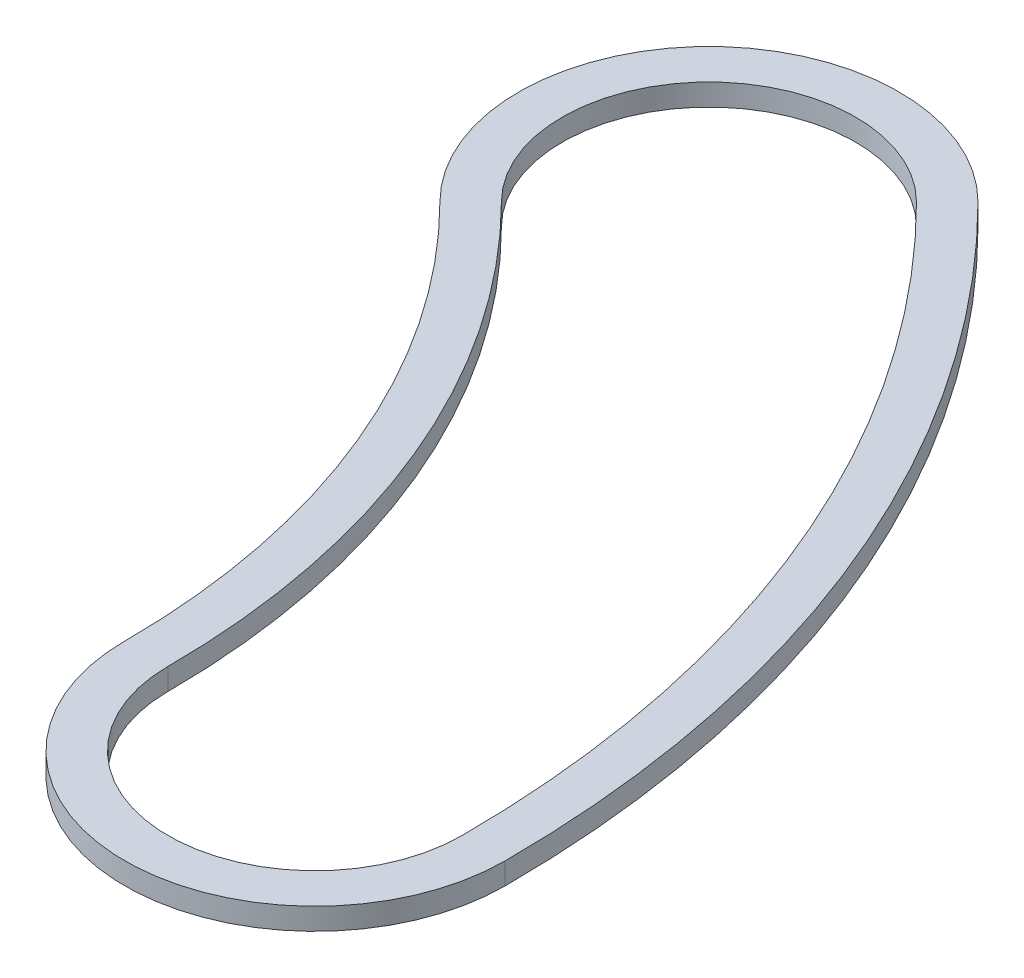
ISO-10303-21;
HEADER;
FILE_DESCRIPTION(('STEP AP214'),'2;1');
FILE_NAME('part.step','',(''),(''),'','','');
FILE_SCHEMA(('AUTOMOTIVE_DESIGN { 1 0 10303 214 1 1 1 1 }'));
ENDSEC;
DATA;
#1=APPLICATION_CONTEXT('core data for automotive mechanical design processes');
#2=APPLICATION_PROTOCOL_DEFINITION('international standard','automotive_design',2000,#1);
#3=PRODUCT_CONTEXT('',#1,'mechanical');
#4=PRODUCT('Part','Part','',(#3));
#5=PRODUCT_RELATED_PRODUCT_CATEGORY('part','',(#4));
#6=PRODUCT_DEFINITION_FORMATION('','',#4);
#7=PRODUCT_DEFINITION_CONTEXT('part definition',#1,'design');
#8=PRODUCT_DEFINITION('design','',#6,#7);
#9=PRODUCT_DEFINITION_SHAPE('','',#8);
#10=(LENGTH_UNIT() NAMED_UNIT(*) SI_UNIT(.MILLI.,.METRE.));
#11=(NAMED_UNIT(*) PLANE_ANGLE_UNIT() SI_UNIT($,.RADIAN.));
#12=(NAMED_UNIT(*) SI_UNIT($,.STERADIAN.) SOLID_ANGLE_UNIT());
#13=UNCERTAINTY_MEASURE_WITH_UNIT(LENGTH_MEASURE(1.E-05),#10,'distance_accuracy_value','');
#14=(GEOMETRIC_REPRESENTATION_CONTEXT(3) GLOBAL_UNCERTAINTY_ASSIGNED_CONTEXT((#13)) GLOBAL_UNIT_ASSIGNED_CONTEXT((#10,
#11,#12)) REPRESENTATION_CONTEXT('',''));
#15=CARTESIAN_POINT('',(0.,0.,0.));
#16=DIRECTION('',(0.,0.,1.));
#17=DIRECTION('',(1.,0.,0.));
#18=AXIS2_PLACEMENT_3D('',#15,#16,#17);
#19=CARTESIAN_POINT('',(11.1125,0.508,0.));
#20=DIRECTION('',(0.,1.,0.));
#21=DIRECTION('',(0.,0.,1.));
#22=AXIS2_PLACEMENT_3D('',#19,#20,#21);
#23=PLANE('',#22);
#24=CARTESIAN_POINT('',(22.225,0.508,0.));
#25=DIRECTION('',(0.,1.,0.));
#26=DIRECTION('',(0.,0.,1.));
#27=AXIS2_PLACEMENT_3D('',#24,#25,#26);
#28=CIRCLE('',#27,4.445);
#29=CARTESIAN_POINT('',(17.78,0.508,0.));
#30=VERTEX_POINT('',#29);
#31=CARTESIAN_POINT('',(26.67,0.508,0.));
#32=VERTEX_POINT('',#31);
#33=EDGE_CURVE('E133',#30,#32,#28,.T.);
#34=ORIENTED_EDGE('',*,*,#33,.T.);
#35=CARTESIAN_POINT('',(0.,0.508,0.));
#36=DIRECTION('',(0.,1.,0.));
#37=DIRECTION('',(0.,0.,1.));
#38=AXIS2_PLACEMENT_3D('',#35,#36,#37);
#39=CIRCLE('',#38,26.67);
#40=CARTESIAN_POINT('',(18.8585378542452,0.508,-18.8585378542453));
#41=VERTEX_POINT('',#40);
#42=EDGE_CURVE('E136',#32,#41,#39,.T.);
#43=ORIENTED_EDGE('',*,*,#42,.T.);
#44=CARTESIAN_POINT('',(15.715448211871,0.508,-15.715448211871));
#45=DIRECTION('',(0.,1.,0.));
#46=DIRECTION('',(0.,0.,1.));
#47=AXIS2_PLACEMENT_3D('',#44,#45,#46);
#48=CIRCLE('',#47,4.445);
#49=CARTESIAN_POINT('',(12.5723585694968,0.508,-12.5723585694968));
#50=VERTEX_POINT('',#49);
#51=EDGE_CURVE('E139',#41,#50,#48,.T.);
#52=ORIENTED_EDGE('',*,*,#51,.T.);
#53=CARTESIAN_POINT('',(0.,0.508,0.));
#54=DIRECTION('',(0.,-1.,0.));
#55=DIRECTION('',(0.,0.,1.));
#56=AXIS2_PLACEMENT_3D('',#53,#54,#55);
#57=CIRCLE('',#56,17.78);
#58=EDGE_CURVE('E141',#50,#30,#57,.T.);
#59=ORIENTED_EDGE('',*,*,#58,.T.);
#60=EDGE_LOOP('',(#34,#43,#52,#59));
#61=FACE_BOUND('',#60,.T.);
#62=CARTESIAN_POINT('',(0.,0.508,0.));
#63=DIRECTION('',(0.,1.,0.));
#64=DIRECTION('',(0.,0.,1.));
#65=AXIS2_PLACEMENT_3D('',#62,#63,#64);
#66=CIRCLE('',#65,25.654);
#67=CARTESIAN_POINT('',(25.654,0.508,0.));
#68=VERTEX_POINT('',#67);
#69=CARTESIAN_POINT('',(18.1401173645597,0.508,-18.1401173645597));
#70=VERTEX_POINT('',#69);
#71=EDGE_CURVE('E105',#68,#70,#66,.T.);
#72=ORIENTED_EDGE('',*,*,#71,.F.);
#73=CARTESIAN_POINT('',(22.225,0.508,0.));
#74=DIRECTION('',(0.,1.,0.));
#75=DIRECTION('',(0.,0.,1.));
#76=AXIS2_PLACEMENT_3D('',#73,#74,#75);
#77=CIRCLE('',#76,3.429);
#78=CARTESIAN_POINT('',(18.796,0.508,0.));
#79=VERTEX_POINT('',#78);
#80=EDGE_CURVE('E97',#79,#68,#77,.T.);
#81=ORIENTED_EDGE('',*,*,#80,.F.);
#82=CARTESIAN_POINT('',(0.,0.508,0.));
#83=DIRECTION('',(0.,-1.,0.));
#84=DIRECTION('',(0.,0.,1.));
#85=AXIS2_PLACEMENT_3D('',#82,#83,#84);
#86=CIRCLE('',#85,18.796);
#87=CARTESIAN_POINT('',(13.2907790591823,0.508,-13.2907790591824));
#88=VERTEX_POINT('',#87);
#89=EDGE_CURVE('E119',#88,#79,#86,.T.);
#90=ORIENTED_EDGE('',*,*,#89,.F.);
#91=CARTESIAN_POINT('',(15.715448211871,0.508,-15.715448211871));
#92=DIRECTION('',(0.,1.,0.));
#93=DIRECTION('',(0.,0.,1.));
#94=AXIS2_PLACEMENT_3D('',#91,#92,#93);
#95=CIRCLE('',#94,3.429);
#96=EDGE_CURVE('E117',#70,#88,#95,.T.);
#97=ORIENTED_EDGE('',*,*,#96,.F.);
#98=EDGE_LOOP('',(#72,#81,#90,#97));
#99=FACE_BOUND('',#98,.T.);
#100=ADVANCED_FACE('F32',(#61,#99),#23,.T.);
#101=CARTESIAN_POINT('',(11.1125,0.,0.));
#102=DIRECTION('',(0.,1.,0.));
#103=DIRECTION('',(0.,0.,1.));
#104=AXIS2_PLACEMENT_3D('',#101,#102,#103);
#105=PLANE('',#104);
#106=CARTESIAN_POINT('',(22.225,0.,0.));
#107=DIRECTION('',(0.,1.,0.));
#108=DIRECTION('',(0.,0.,1.));
#109=AXIS2_PLACEMENT_3D('',#106,#107,#108);
#110=CIRCLE('',#109,4.445);
#111=CARTESIAN_POINT('',(17.78,0.,0.));
#112=VERTEX_POINT('',#111);
#113=CARTESIAN_POINT('',(26.67,0.,0.));
#114=VERTEX_POINT('',#113);
#115=EDGE_CURVE('E113',#112,#114,#110,.T.);
#116=ORIENTED_EDGE('',*,*,#115,.F.);
#117=CARTESIAN_POINT('',(0.,0.,0.));
#118=DIRECTION('',(0.,-1.,0.));
#119=DIRECTION('',(0.,0.,1.));
#120=AXIS2_PLACEMENT_3D('',#117,#118,#119);
#121=CIRCLE('',#120,17.78);
#122=CARTESIAN_POINT('',(12.5723585694968,0.,-12.5723585694968));
#123=VERTEX_POINT('',#122);
#124=EDGE_CURVE('E137',#123,#112,#121,.T.);
#125=ORIENTED_EDGE('',*,*,#124,.F.);
#126=CARTESIAN_POINT('',(15.715448211871,0.,-15.715448211871));
#127=DIRECTION('',(0.,1.,0.));
#128=DIRECTION('',(0.,0.,1.));
#129=AXIS2_PLACEMENT_3D('',#126,#127,#128);
#130=CIRCLE('',#129,4.445);
#131=CARTESIAN_POINT('',(18.8585378542452,0.,-18.8585378542453));
#132=VERTEX_POINT('',#131);
#133=EDGE_CURVE('E148',#132,#123,#130,.T.);
#134=ORIENTED_EDGE('',*,*,#133,.F.);
#135=CARTESIAN_POINT('',(0.,0.,0.));
#136=DIRECTION('',(0.,1.,0.));
#137=DIRECTION('',(0.,0.,1.));
#138=AXIS2_PLACEMENT_3D('',#135,#136,#137);
#139=CIRCLE('',#138,26.67);
#140=EDGE_CURVE('E146',#114,#132,#139,.T.);
#141=ORIENTED_EDGE('',*,*,#140,.F.);
#142=EDGE_LOOP('',(#116,#125,#134,#141));
#143=FACE_BOUND('',#142,.T.);
#144=CARTESIAN_POINT('',(22.225,0.,0.));
#145=DIRECTION('',(0.,1.,0.));
#146=DIRECTION('',(0.,0.,1.));
#147=AXIS2_PLACEMENT_3D('',#144,#145,#146);
#148=CIRCLE('',#147,3.429);
#149=CARTESIAN_POINT('',(18.796,0.,0.));
#150=VERTEX_POINT('',#149);
#151=CARTESIAN_POINT('',(25.654,0.,0.));
#152=VERTEX_POINT('',#151);
#153=EDGE_CURVE('E55',#150,#152,#148,.T.);
#154=ORIENTED_EDGE('',*,*,#153,.T.);
#155=CARTESIAN_POINT('',(0.,0.,0.));
#156=DIRECTION('',(0.,1.,0.));
#157=DIRECTION('',(0.,0.,1.));
#158=AXIS2_PLACEMENT_3D('',#155,#156,#157);
#159=CIRCLE('',#158,25.654);
#160=CARTESIAN_POINT('',(18.1401173645597,0.,-18.1401173645597));
#161=VERTEX_POINT('',#160);
#162=EDGE_CURVE('E112',#152,#161,#159,.T.);
#163=ORIENTED_EDGE('',*,*,#162,.T.);
#164=CARTESIAN_POINT('',(15.715448211871,0.,-15.715448211871));
#165=DIRECTION('',(0.,1.,0.));
#166=DIRECTION('',(0.,0.,1.));
#167=AXIS2_PLACEMENT_3D('',#164,#165,#166);
#168=CIRCLE('',#167,3.429);
#169=CARTESIAN_POINT('',(13.2907790591823,0.,-13.2907790591824));
#170=VERTEX_POINT('',#169);
#171=EDGE_CURVE('E125',#161,#170,#168,.T.);
#172=ORIENTED_EDGE('',*,*,#171,.T.);
#173=CARTESIAN_POINT('',(0.,0.,0.));
#174=DIRECTION('',(0.,-1.,0.));
#175=DIRECTION('',(0.,0.,1.));
#176=AXIS2_PLACEMENT_3D('',#173,#174,#175);
#177=CIRCLE('',#176,18.796);
#178=EDGE_CURVE('E106',#170,#150,#177,.T.);
#179=ORIENTED_EDGE('',*,*,#178,.T.);
#180=EDGE_LOOP('',(#154,#163,#172,#179));
#181=FACE_BOUND('',#180,.T.);
#182=ADVANCED_FACE('F166',(#143,#181),#105,.F.);
#183=CARTESIAN_POINT('',(22.225,0.508,0.));
#184=DIRECTION('',(0.,-1.,0.));
#185=DIRECTION('',(0.,0.,-1.));
#186=AXIS2_PLACEMENT_3D('',#183,#184,#185);
#187=CYLINDRICAL_SURFACE('',#186,4.445);
#188=ORIENTED_EDGE('',*,*,#115,.T.);
#189=DIRECTION('',(0.,-1.,0.));
#190=VECTOR('',#189,1.);
#191=CARTESIAN_POINT('',(26.67,0.508,0.));
#192=LINE('',#191,#190);
#193=EDGE_CURVE('E11',#32,#114,#192,.T.);
#194=ORIENTED_EDGE('',*,*,#193,.F.);
#195=ORIENTED_EDGE('',*,*,#33,.F.);
#196=DIRECTION('',(0.,-1.,0.));
#197=VECTOR('',#196,1.);
#198=CARTESIAN_POINT('',(17.78,0.508,0.));
#199=LINE('',#198,#197);
#200=EDGE_CURVE('E143',#30,#112,#199,.T.);
#201=ORIENTED_EDGE('',*,*,#200,.T.);
#202=EDGE_LOOP('',(#188,#194,#195,#201));
#203=FACE_BOUND('',#202,.T.);
#204=ADVANCED_FACE('F34',(#203),#187,.T.);
#205=CARTESIAN_POINT('',(0.,0.508,0.));
#206=DIRECTION('',(0.,-1.,0.));
#207=DIRECTION('',(0.,0.,-1.));
#208=AXIS2_PLACEMENT_3D('',#205,#206,#207);
#209=CYLINDRICAL_SURFACE('',#208,26.67);
#210=ORIENTED_EDGE('',*,*,#140,.T.);
#211=DIRECTION('',(0.,-1.,0.));
#212=VECTOR('',#211,1.);
#213=CARTESIAN_POINT('',(18.8585378542452,0.508,-18.8585378542453));
#214=LINE('',#213,#212);
#215=EDGE_CURVE('E40',#41,#132,#214,.T.);
#216=ORIENTED_EDGE('',*,*,#215,.F.);
#217=ORIENTED_EDGE('',*,*,#42,.F.);
#218=ORIENTED_EDGE('',*,*,#193,.T.);
#219=EDGE_LOOP('',(#210,#216,#217,#218));
#220=FACE_BOUND('',#219,.T.);
#221=ADVANCED_FACE('F176',(#220),#209,.T.);
#222=CARTESIAN_POINT('',(15.715448211871,0.508,-15.715448211871));
#223=DIRECTION('',(0.,-1.,0.));
#224=DIRECTION('',(0.,0.,-1.));
#225=AXIS2_PLACEMENT_3D('',#222,#223,#224);
#226=CYLINDRICAL_SURFACE('',#225,4.445);
#227=ORIENTED_EDGE('',*,*,#133,.T.);
#228=DIRECTION('',(0.,-1.,0.));
#229=VECTOR('',#228,1.);
#230=CARTESIAN_POINT('',(12.5723585694968,0.508,-12.5723585694968));
#231=LINE('',#230,#229);
#232=EDGE_CURVE('E153',#50,#123,#231,.T.);
#233=ORIENTED_EDGE('',*,*,#232,.F.);
#234=ORIENTED_EDGE('',*,*,#51,.F.);
#235=ORIENTED_EDGE('',*,*,#215,.T.);
#236=EDGE_LOOP('',(#227,#233,#234,#235));
#237=FACE_BOUND('',#236,.T.);
#238=ADVANCED_FACE('F160',(#237),#226,.T.);
#239=CARTESIAN_POINT('',(0.,0.508,0.));
#240=DIRECTION('',(0.,-1.,0.));
#241=DIRECTION('',(0.,0.,-1.));
#242=AXIS2_PLACEMENT_3D('',#239,#240,#241);
#243=CYLINDRICAL_SURFACE('',#242,17.78);
#244=ORIENTED_EDGE('',*,*,#124,.T.);
#245=ORIENTED_EDGE('',*,*,#200,.F.);
#246=ORIENTED_EDGE('',*,*,#58,.F.);
#247=ORIENTED_EDGE('',*,*,#232,.T.);
#248=EDGE_LOOP('',(#244,#245,#246,#247));
#249=FACE_BOUND('',#248,.T.);
#250=ADVANCED_FACE('F170',(#249),#243,.F.);
#251=CARTESIAN_POINT('',(22.225,0.508,0.));
#252=DIRECTION('',(0.,-1.,0.));
#253=DIRECTION('',(0.,0.,-1.));
#254=AXIS2_PLACEMENT_3D('',#251,#252,#253);
#255=CYLINDRICAL_SURFACE('',#254,3.429);
#256=ORIENTED_EDGE('',*,*,#153,.F.);
#257=DIRECTION('',(0.,-1.,0.));
#258=VECTOR('',#257,1.);
#259=CARTESIAN_POINT('',(18.796,0.508,0.));
#260=LINE('',#259,#258);
#261=EDGE_CURVE('E101',#79,#150,#260,.T.);
#262=ORIENTED_EDGE('',*,*,#261,.F.);
#263=ORIENTED_EDGE('',*,*,#80,.T.);
#264=DIRECTION('',(0.,-1.,0.));
#265=VECTOR('',#264,1.);
#266=CARTESIAN_POINT('',(25.654,0.508,0.));
#267=LINE('',#266,#265);
#268=EDGE_CURVE('E100',#68,#152,#267,.T.);
#269=ORIENTED_EDGE('',*,*,#268,.T.);
#270=EDGE_LOOP('',(#256,#262,#263,#269));
#271=FACE_BOUND('',#270,.T.);
#272=ADVANCED_FACE('F99',(#271),#255,.F.);
#273=CARTESIAN_POINT('',(0.,0.508,0.));
#274=DIRECTION('',(0.,-1.,0.));
#275=DIRECTION('',(0.,0.,-1.));
#276=AXIS2_PLACEMENT_3D('',#273,#274,#275);
#277=CYLINDRICAL_SURFACE('',#276,25.654);
#278=ORIENTED_EDGE('',*,*,#162,.F.);
#279=ORIENTED_EDGE('',*,*,#268,.F.);
#280=ORIENTED_EDGE('',*,*,#71,.T.);
#281=DIRECTION('',(0.,-1.,0.));
#282=VECTOR('',#281,1.);
#283=CARTESIAN_POINT('',(18.1401173645597,0.508,-18.1401173645597));
#284=LINE('',#283,#282);
#285=EDGE_CURVE('E114',#70,#161,#284,.T.);
#286=ORIENTED_EDGE('',*,*,#285,.T.);
#287=EDGE_LOOP('',(#278,#279,#280,#286));
#288=FACE_BOUND('',#287,.T.);
#289=ADVANCED_FACE('F109',(#288),#277,.F.);
#290=CARTESIAN_POINT('',(15.715448211871,0.508,-15.715448211871));
#291=DIRECTION('',(0.,-1.,0.));
#292=DIRECTION('',(0.,0.,-1.));
#293=AXIS2_PLACEMENT_3D('',#290,#291,#292);
#294=CYLINDRICAL_SURFACE('',#293,3.429);
#295=ORIENTED_EDGE('',*,*,#171,.F.);
#296=ORIENTED_EDGE('',*,*,#285,.F.);
#297=ORIENTED_EDGE('',*,*,#96,.T.);
#298=DIRECTION('',(0.,-1.,0.));
#299=VECTOR('',#298,1.);
#300=CARTESIAN_POINT('',(13.2907790591823,0.508,-13.2907790591824));
#301=LINE('',#300,#299);
#302=EDGE_CURVE('E47',#88,#170,#301,.T.);
#303=ORIENTED_EDGE('',*,*,#302,.T.);
#304=EDGE_LOOP('',(#295,#296,#297,#303));
#305=FACE_BOUND('',#304,.T.);
#306=ADVANCED_FACE('F199',(#305),#294,.F.);
#307=CARTESIAN_POINT('',(0.,0.508,0.));
#308=DIRECTION('',(0.,-1.,0.));
#309=DIRECTION('',(0.,0.,-1.));
#310=AXIS2_PLACEMENT_3D('',#307,#308,#309);
#311=CYLINDRICAL_SURFACE('',#310,18.796);
#312=ORIENTED_EDGE('',*,*,#178,.F.);
#313=ORIENTED_EDGE('',*,*,#302,.F.);
#314=ORIENTED_EDGE('',*,*,#89,.T.);
#315=ORIENTED_EDGE('',*,*,#261,.T.);
#316=EDGE_LOOP('',(#312,#313,#314,#315));
#317=FACE_BOUND('',#316,.T.);
#318=ADVANCED_FACE('F203',(#317),#311,.T.);
#319=CLOSED_SHELL('',(#100,#182,#204,#221,#238,#250,#272,#289,#306,#318));
#320=MANIFOLD_SOLID_BREP('B2',#319);
#321=ADVANCED_BREP_SHAPE_REPRESENTATION('',(#18,#320),#14);
#322=SHAPE_DEFINITION_REPRESENTATION(#9,#321);
ENDSEC;
END-ISO-10303-21;
